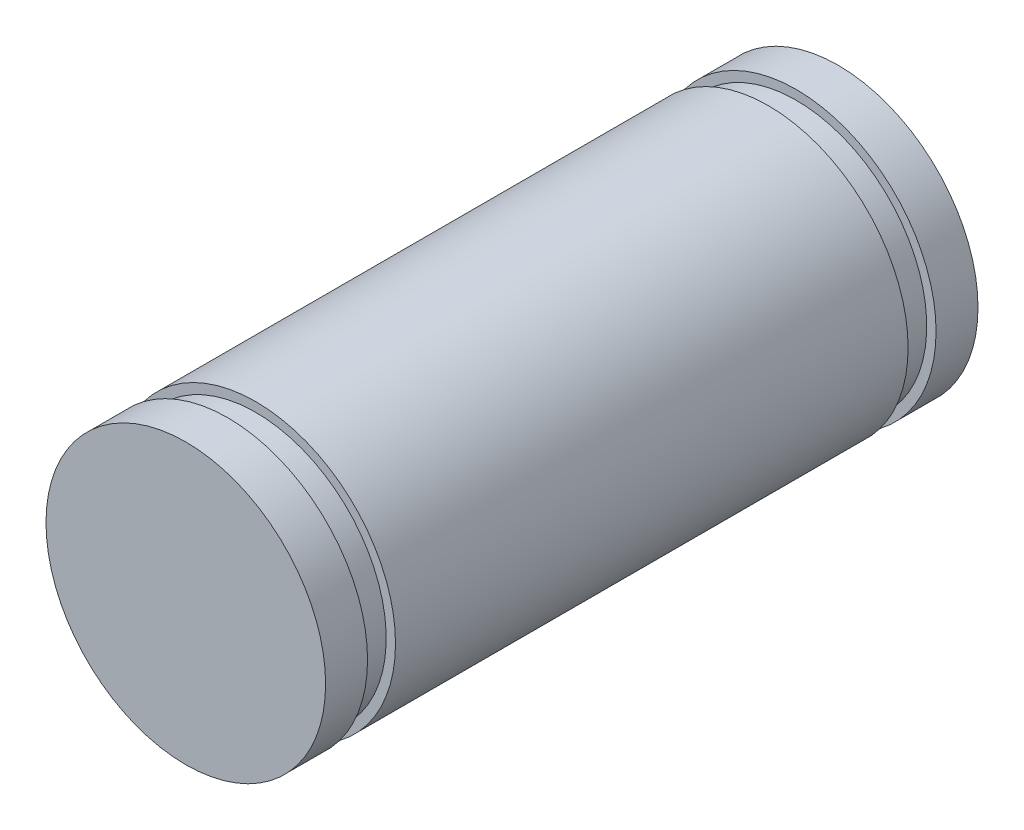
ISO-10303-21;
HEADER;
FILE_DESCRIPTION(('STEP AP214'),'2;1');
FILE_NAME('part.step','',(''),(''),'','','');
FILE_SCHEMA(('AUTOMOTIVE_DESIGN { 1 0 10303 214 1 1 1 1 }'));
ENDSEC;
DATA;
#1=APPLICATION_CONTEXT('core data for automotive mechanical design processes');
#2=APPLICATION_PROTOCOL_DEFINITION('international standard','automotive_design',2000,#1);
#3=PRODUCT_CONTEXT('',#1,'mechanical');
#4=PRODUCT('Part','Part','',(#3));
#5=PRODUCT_RELATED_PRODUCT_CATEGORY('part','',(#4));
#6=PRODUCT_DEFINITION_FORMATION('','',#4);
#7=PRODUCT_DEFINITION_CONTEXT('part definition',#1,'design');
#8=PRODUCT_DEFINITION('design','',#6,#7);
#9=PRODUCT_DEFINITION_SHAPE('','',#8);
#10=(LENGTH_UNIT() NAMED_UNIT(*) SI_UNIT(.MILLI.,.METRE.));
#11=(NAMED_UNIT(*) PLANE_ANGLE_UNIT() SI_UNIT($,.RADIAN.));
#12=(NAMED_UNIT(*) SI_UNIT($,.STERADIAN.) SOLID_ANGLE_UNIT());
#13=UNCERTAINTY_MEASURE_WITH_UNIT(LENGTH_MEASURE(1.E-05),#10,'distance_accuracy_value','');
#14=(GEOMETRIC_REPRESENTATION_CONTEXT(3) GLOBAL_UNCERTAINTY_ASSIGNED_CONTEXT((#13)) GLOBAL_UNIT_ASSIGNED_CONTEXT((#10,
#11,#12)) REPRESENTATION_CONTEXT('',''));
#15=CARTESIAN_POINT('',(0.,0.,0.));
#16=DIRECTION('',(0.,0.,1.));
#17=DIRECTION('',(1.,0.,0.));
#18=AXIS2_PLACEMENT_3D('',#15,#16,#17);
#19=CARTESIAN_POINT('',(0.,0.,14.));
#20=DIRECTION('',(0.,0.,1.));
#21=DIRECTION('',(1.,0.,0.));
#22=AXIS2_PLACEMENT_3D('',#19,#20,#21);
#23=PLANE('',#22);
#24=CARTESIAN_POINT('',(0.,0.,14.));
#25=DIRECTION('',(0.,0.,-1.));
#26=DIRECTION('',(-1.,0.,0.));
#27=AXIS2_PLACEMENT_3D('',#24,#25,#26);
#28=CIRCLE('',#27,3.);
#29=CARTESIAN_POINT('',(-3.,0.,14.));
#30=VERTEX_POINT('',#29);
#31=EDGE_CURVE('E17',#30,#30,#28,.T.);
#32=ORIENTED_EDGE('',*,*,#31,.F.);
#33=EDGE_LOOP('',(#32));
#34=FACE_BOUND('',#33,.T.);
#35=ADVANCED_FACE('F14',(#34),#23,.T.);
#36=CARTESIAN_POINT('',(0.,0.,0.));
#37=DIRECTION('',(0.,0.,1.));
#38=DIRECTION('',(1.,0.,0.));
#39=AXIS2_PLACEMENT_3D('',#36,#37,#38);
#40=PLANE('',#39);
#41=CARTESIAN_POINT('',(0.,0.,0.));
#42=DIRECTION('',(0.,0.,-1.));
#43=DIRECTION('',(-1.,0.,0.));
#44=AXIS2_PLACEMENT_3D('',#41,#42,#43);
#45=CIRCLE('',#44,3.);
#46=CARTESIAN_POINT('',(-3.,0.,0.));
#47=VERTEX_POINT('',#46);
#48=EDGE_CURVE('E45',#47,#47,#45,.F.);
#49=ORIENTED_EDGE('',*,*,#48,.F.);
#50=EDGE_LOOP('',(#49));
#51=FACE_BOUND('',#50,.T.);
#52=ADVANCED_FACE('F63',(#51),#40,.F.);
#53=CARTESIAN_POINT('',(0.,0.,14.));
#54=DIRECTION('',(0.,0.,-1.));
#55=DIRECTION('',(-1.,0.,0.));
#56=AXIS2_PLACEMENT_3D('',#53,#54,#55);
#57=CYLINDRICAL_SURFACE('',#56,3.);
#58=ORIENTED_EDGE('',*,*,#31,.T.);
#59=EDGE_LOOP('',(#58));
#60=FACE_BOUND('',#59,.T.);
#61=CARTESIAN_POINT('',(0.,0.,13.1));
#62=DIRECTION('',(0.,0.,-1.));
#63=DIRECTION('',(-1.,0.,0.));
#64=AXIS2_PLACEMENT_3D('',#61,#62,#63);
#65=CIRCLE('',#64,3.);
#66=CARTESIAN_POINT('',(-3.,0.,13.1));
#67=VERTEX_POINT('',#66);
#68=EDGE_CURVE('E43',#67,#67,#65,.T.);
#69=ORIENTED_EDGE('',*,*,#68,.F.);
#70=EDGE_LOOP('',(#69));
#71=FACE_BOUND('',#70,.T.);
#72=ADVANCED_FACE('F59',(#60,#71),#57,.T.);
#73=CARTESIAN_POINT('',(0.,0.,14.));
#74=DIRECTION('',(0.,0.,-1.));
#75=DIRECTION('',(-1.,0.,0.));
#76=AXIS2_PLACEMENT_3D('',#73,#74,#75);
#77=CYLINDRICAL_SURFACE('',#76,3.);
#78=CARTESIAN_POINT('',(0.,0.,0.9));
#79=DIRECTION('',(0.,0.,-1.));
#80=DIRECTION('',(-1.,0.,0.));
#81=AXIS2_PLACEMENT_3D('',#78,#79,#80);
#82=CIRCLE('',#81,3.);
#83=CARTESIAN_POINT('',(-3.,0.,0.9));
#84=VERTEX_POINT('',#83);
#85=EDGE_CURVE('E40',#84,#84,#82,.F.);
#86=ORIENTED_EDGE('',*,*,#85,.F.);
#87=EDGE_LOOP('',(#86));
#88=FACE_BOUND('',#87,.T.);
#89=ORIENTED_EDGE('',*,*,#48,.T.);
#90=EDGE_LOOP('',(#89));
#91=FACE_BOUND('',#90,.T.);
#92=ADVANCED_FACE('F99',(#88,#91),#77,.T.);
#93=CARTESIAN_POINT('',(3.,0.,13.1));
#94=DIRECTION('',(0.,0.,-1.));
#95=DIRECTION('',(-1.,0.,0.));
#96=AXIS2_PLACEMENT_3D('',#93,#94,#95);
#97=PLANE('',#96);
#98=CARTESIAN_POINT('',(0.,0.,13.1));
#99=DIRECTION('',(0.,0.,-1.));
#100=DIRECTION('',(-1.,0.,0.));
#101=AXIS2_PLACEMENT_3D('',#98,#99,#100);
#102=CIRCLE('',#101,2.8);
#103=CARTESIAN_POINT('',(-2.8,0.,13.1));
#104=VERTEX_POINT('',#103);
#105=EDGE_CURVE('E37',#104,#104,#102,.T.);
#106=ORIENTED_EDGE('',*,*,#105,.F.);
#107=EDGE_LOOP('',(#106));
#108=FACE_BOUND('',#107,.T.);
#109=ORIENTED_EDGE('',*,*,#68,.T.);
#110=EDGE_LOOP('',(#109));
#111=FACE_BOUND('',#110,.T.);
#112=ADVANCED_FACE('F95',(#108,#111),#97,.T.);
#113=CARTESIAN_POINT('',(3.,0.,0.9));
#114=DIRECTION('',(0.,0.,1.));
#115=DIRECTION('',(1.,0.,0.));
#116=AXIS2_PLACEMENT_3D('',#113,#114,#115);
#117=PLANE('',#116);
#118=ORIENTED_EDGE('',*,*,#85,.T.);
#119=EDGE_LOOP('',(#118));
#120=FACE_BOUND('',#119,.T.);
#121=CARTESIAN_POINT('',(0.,0.,0.9));
#122=DIRECTION('',(0.,0.,-1.));
#123=DIRECTION('',(-1.,0.,0.));
#124=AXIS2_PLACEMENT_3D('',#121,#122,#123);
#125=CIRCLE('',#124,2.8);
#126=CARTESIAN_POINT('',(-2.8,0.,0.9));
#127=VERTEX_POINT('',#126);
#128=EDGE_CURVE('E34',#127,#127,#125,.F.);
#129=ORIENTED_EDGE('',*,*,#128,.F.);
#130=EDGE_LOOP('',(#129));
#131=FACE_BOUND('',#130,.T.);
#132=ADVANCED_FACE('F91',(#120,#131),#117,.T.);
#133=CARTESIAN_POINT('',(0.,0.,0.));
#134=DIRECTION('',(0.,0.,-1.));
#135=DIRECTION('',(-1.,0.,0.));
#136=AXIS2_PLACEMENT_3D('',#133,#134,#135);
#137=CYLINDRICAL_SURFACE('',#136,2.8);
#138=ORIENTED_EDGE('',*,*,#105,.T.);
#139=EDGE_LOOP('',(#138));
#140=FACE_BOUND('',#139,.T.);
#141=CARTESIAN_POINT('',(0.,0.,12.5));
#142=DIRECTION('',(0.,0.,-1.));
#143=DIRECTION('',(-1.,0.,0.));
#144=AXIS2_PLACEMENT_3D('',#141,#142,#143);
#145=CIRCLE('',#144,2.8);
#146=CARTESIAN_POINT('',(-2.8,0.,12.5));
#147=VERTEX_POINT('',#146);
#148=EDGE_CURVE('E31',#147,#147,#145,.T.);
#149=ORIENTED_EDGE('',*,*,#148,.F.);
#150=EDGE_LOOP('',(#149));
#151=FACE_BOUND('',#150,.T.);
#152=ADVANCED_FACE('F87',(#140,#151),#137,.T.);
#153=CARTESIAN_POINT('',(0.,0.,0.));
#154=DIRECTION('',(0.,0.,-1.));
#155=DIRECTION('',(-1.,0.,0.));
#156=AXIS2_PLACEMENT_3D('',#153,#154,#155);
#157=CYLINDRICAL_SURFACE('',#156,2.8);
#158=CARTESIAN_POINT('',(0.,0.,1.5));
#159=DIRECTION('',(0.,0.,-1.));
#160=DIRECTION('',(-1.,0.,0.));
#161=AXIS2_PLACEMENT_3D('',#158,#159,#160);
#162=CIRCLE('',#161,2.8);
#163=CARTESIAN_POINT('',(-2.8,0.,1.5));
#164=VERTEX_POINT('',#163);
#165=EDGE_CURVE('E26',#164,#164,#162,.F.);
#166=ORIENTED_EDGE('',*,*,#165,.F.);
#167=EDGE_LOOP('',(#166));
#168=FACE_BOUND('',#167,.T.);
#169=ORIENTED_EDGE('',*,*,#128,.T.);
#170=EDGE_LOOP('',(#169));
#171=FACE_BOUND('',#170,.T.);
#172=ADVANCED_FACE('F83',(#168,#171),#157,.T.);
#173=CARTESIAN_POINT('',(3.,0.,12.5));
#174=DIRECTION('',(0.,0.,1.));
#175=DIRECTION('',(1.,0.,0.));
#176=AXIS2_PLACEMENT_3D('',#173,#174,#175);
#177=PLANE('',#176);
#178=CARTESIAN_POINT('',(0.,0.,12.5));
#179=DIRECTION('',(0.,0.,-1.));
#180=DIRECTION('',(-1.,0.,0.));
#181=AXIS2_PLACEMENT_3D('',#178,#179,#180);
#182=CIRCLE('',#181,3.);
#183=CARTESIAN_POINT('',(-3.,0.,12.5));
#184=VERTEX_POINT('',#183);
#185=EDGE_CURVE('E21',#184,#184,#182,.T.);
#186=ORIENTED_EDGE('',*,*,#185,.F.);
#187=EDGE_LOOP('',(#186));
#188=FACE_BOUND('',#187,.T.);
#189=ORIENTED_EDGE('',*,*,#148,.T.);
#190=EDGE_LOOP('',(#189));
#191=FACE_BOUND('',#190,.T.);
#192=ADVANCED_FACE('F76',(#188,#191),#177,.T.);
#193=CARTESIAN_POINT('',(3.,0.,1.5));
#194=DIRECTION('',(0.,0.,-1.));
#195=DIRECTION('',(-1.,0.,0.));
#196=AXIS2_PLACEMENT_3D('',#193,#194,#195);
#197=PLANE('',#196);
#198=ORIENTED_EDGE('',*,*,#165,.T.);
#199=EDGE_LOOP('',(#198));
#200=FACE_BOUND('',#199,.T.);
#201=CARTESIAN_POINT('',(0.,0.,1.5));
#202=DIRECTION('',(0.,0.,-1.));
#203=DIRECTION('',(-1.,0.,0.));
#204=AXIS2_PLACEMENT_3D('',#201,#202,#203);
#205=CIRCLE('',#204,3.);
#206=CARTESIAN_POINT('',(-3.,0.,1.5));
#207=VERTEX_POINT('',#206);
#208=EDGE_CURVE('E10',#207,#207,#205,.F.);
#209=ORIENTED_EDGE('',*,*,#208,.F.);
#210=EDGE_LOOP('',(#209));
#211=FACE_BOUND('',#210,.T.);
#212=ADVANCED_FACE('F71',(#200,#211),#197,.T.);
#213=CARTESIAN_POINT('',(0.,0.,14.));
#214=DIRECTION('',(0.,0.,-1.));
#215=DIRECTION('',(-1.,0.,0.));
#216=AXIS2_PLACEMENT_3D('',#213,#214,#215);
#217=CYLINDRICAL_SURFACE('',#216,3.);
#218=ORIENTED_EDGE('',*,*,#208,.T.);
#219=EDGE_LOOP('',(#218));
#220=FACE_BOUND('',#219,.T.);
#221=ORIENTED_EDGE('',*,*,#185,.T.);
#222=EDGE_LOOP('',(#221));
#223=FACE_BOUND('',#222,.T.);
#224=ADVANCED_FACE('F69',(#220,#223),#217,.T.);
#225=CLOSED_SHELL('',(#35,#52,#72,#92,#112,#132,#152,#172,#192,#212,#224));
#226=MANIFOLD_SOLID_BREP('B1',#225);
#227=ADVANCED_BREP_SHAPE_REPRESENTATION('',(#18,#226),#14);
#228=SHAPE_DEFINITION_REPRESENTATION(#9,#227);
ENDSEC;
END-ISO-10303-21;
